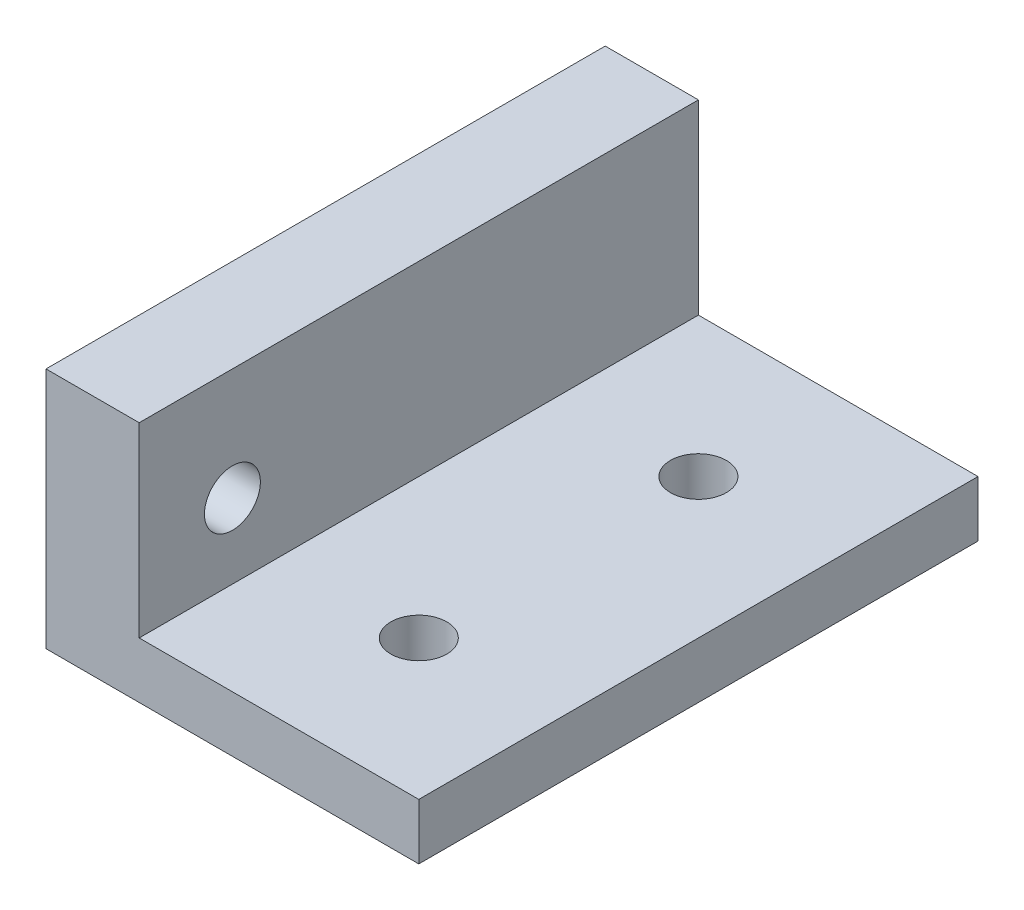
ISO-10303-21;
HEADER;
FILE_DESCRIPTION(('STEP AP214'),'2;1');
FILE_NAME('part.step','',(''),(''),'','','');
FILE_SCHEMA(('AUTOMOTIVE_DESIGN { 1 0 10303 214 1 1 1 1 }'));
ENDSEC;
DATA;
#1=APPLICATION_CONTEXT('core data for automotive mechanical design processes');
#2=APPLICATION_PROTOCOL_DEFINITION('international standard','automotive_design',2000,#1);
#3=PRODUCT_CONTEXT('',#1,'mechanical');
#4=PRODUCT('Part','Part','',(#3));
#5=PRODUCT_RELATED_PRODUCT_CATEGORY('part','',(#4));
#6=PRODUCT_DEFINITION_FORMATION('','',#4);
#7=PRODUCT_DEFINITION_CONTEXT('part definition',#1,'design');
#8=PRODUCT_DEFINITION('design','',#6,#7);
#9=PRODUCT_DEFINITION_SHAPE('','',#8);
#10=(LENGTH_UNIT() NAMED_UNIT(*) SI_UNIT(.MILLI.,.METRE.));
#11=(NAMED_UNIT(*) PLANE_ANGLE_UNIT() SI_UNIT($,.RADIAN.));
#12=(NAMED_UNIT(*) SI_UNIT($,.STERADIAN.) SOLID_ANGLE_UNIT());
#13=UNCERTAINTY_MEASURE_WITH_UNIT(LENGTH_MEASURE(1.E-05),#10,'distance_accuracy_value','');
#14=(GEOMETRIC_REPRESENTATION_CONTEXT(3) GLOBAL_UNCERTAINTY_ASSIGNED_CONTEXT((#13)) GLOBAL_UNIT_ASSIGNED_CONTEXT((#10,
#11,#12)) REPRESENTATION_CONTEXT('',''));
#15=CARTESIAN_POINT('',(0.,0.,0.));
#16=DIRECTION('',(0.,0.,1.));
#17=DIRECTION('',(1.,0.,0.));
#18=AXIS2_PLACEMENT_3D('',#15,#16,#17);
#19=CARTESIAN_POINT('',(10.,3.,-15.));
#20=DIRECTION('',(-1.,0.,0.));
#21=DIRECTION('',(0.,0.,1.));
#22=AXIS2_PLACEMENT_3D('',#19,#20,#21);
#23=PLANE('',#22);
#24=DIRECTION('',(0.,0.,-1.));
#25=VECTOR('',#24,1.);
#26=CARTESIAN_POINT('',(10.,0.,-15.));
#27=LINE('',#26,#25);
#28=CARTESIAN_POINT('',(10.,0.,15.));
#29=VERTEX_POINT('',#28);
#30=CARTESIAN_POINT('',(10.,0.,-15.));
#31=VERTEX_POINT('',#30);
#32=EDGE_CURVE('E98',#29,#31,#27,.T.);
#33=ORIENTED_EDGE('',*,*,#32,.T.);
#34=DIRECTION('',(0.,-1.,0.));
#35=VECTOR('',#34,1.);
#36=CARTESIAN_POINT('',(10.,3.,-15.));
#37=LINE('',#36,#35);
#38=CARTESIAN_POINT('',(10.,3.,-15.));
#39=VERTEX_POINT('',#38);
#40=EDGE_CURVE('E11',#39,#31,#37,.T.);
#41=ORIENTED_EDGE('',*,*,#40,.F.);
#42=DIRECTION('',(0.,0.,-1.));
#43=VECTOR('',#42,1.);
#44=CARTESIAN_POINT('',(10.,3.,-15.));
#45=LINE('',#44,#43);
#46=CARTESIAN_POINT('',(10.,3.,15.));
#47=VERTEX_POINT('',#46);
#48=EDGE_CURVE('E92',#47,#39,#45,.T.);
#49=ORIENTED_EDGE('',*,*,#48,.F.);
#50=DIRECTION('',(0.,-1.,0.));
#51=VECTOR('',#50,1.);
#52=CARTESIAN_POINT('',(10.,3.,15.));
#53=LINE('',#52,#51);
#54=EDGE_CURVE('E83',#47,#29,#53,.T.);
#55=ORIENTED_EDGE('',*,*,#54,.T.);
#56=EDGE_LOOP('',(#33,#41,#49,#55));
#57=FACE_BOUND('',#56,.T.);
#58=ADVANCED_FACE('F39',(#57),#23,.F.);
#59=CARTESIAN_POINT('',(-10.,3.,-15.));
#60=DIRECTION('',(0.,0.,1.));
#61=DIRECTION('',(1.,0.,0.));
#62=AXIS2_PLACEMENT_3D('',#59,#60,#61);
#63=PLANE('',#62);
#64=DIRECTION('',(-1.,0.,0.));
#65=VECTOR('',#64,1.);
#66=CARTESIAN_POINT('',(-10.,0.,-15.));
#67=LINE('',#66,#65);
#68=CARTESIAN_POINT('',(-10.,0.,-15.));
#69=VERTEX_POINT('',#68);
#70=EDGE_CURVE('E102',#31,#69,#67,.T.);
#71=ORIENTED_EDGE('',*,*,#70,.T.);
#72=DIRECTION('',(0.,-1.,0.));
#73=VECTOR('',#72,1.);
#74=CARTESIAN_POINT('',(-10.,3.,-15.));
#75=LINE('',#74,#73);
#76=CARTESIAN_POINT('',(-10.,13.,-15.));
#77=VERTEX_POINT('',#76);
#78=EDGE_CURVE('E48',#77,#69,#75,.T.);
#79=ORIENTED_EDGE('',*,*,#78,.F.);
#80=DIRECTION('',(-1.,0.,0.));
#81=VECTOR('',#80,1.);
#82=CARTESIAN_POINT('',(-10.,13.,-15.));
#83=LINE('',#82,#81);
#84=CARTESIAN_POINT('',(-5.,13.,-15.));
#85=VERTEX_POINT('',#84);
#86=EDGE_CURVE('E133',#85,#77,#83,.T.);
#87=ORIENTED_EDGE('',*,*,#86,.F.);
#88=DIRECTION('',(0.,-1.,0.));
#89=VECTOR('',#88,1.);
#90=CARTESIAN_POINT('',(-5.,13.,-15.));
#91=LINE('',#90,#89);
#92=CARTESIAN_POINT('',(-5.,3.,-15.));
#93=VERTEX_POINT('',#92);
#94=EDGE_CURVE('E110',#85,#93,#91,.T.);
#95=ORIENTED_EDGE('',*,*,#94,.T.);
#96=DIRECTION('',(-1.,0.,0.));
#97=VECTOR('',#96,1.);
#98=CARTESIAN_POINT('',(-10.,3.,-15.));
#99=LINE('',#98,#97);
#100=EDGE_CURVE('E155',#39,#93,#99,.T.);
#101=ORIENTED_EDGE('',*,*,#100,.F.);
#102=ORIENTED_EDGE('',*,*,#40,.T.);
#103=EDGE_LOOP('',(#71,#79,#87,#95,#101,#102));
#104=FACE_BOUND('',#103,.T.);
#105=ADVANCED_FACE('F130',(#104),#63,.F.);
#106=CARTESIAN_POINT('',(-10.,3.,-15.));
#107=DIRECTION('',(1.,0.,0.));
#108=DIRECTION('',(0.,0.,-1.));
#109=AXIS2_PLACEMENT_3D('',#106,#107,#108);
#110=PLANE('',#109);
#111=CARTESIAN_POINT('',(-10.,7.,10.));
#112=DIRECTION('',(-1.,0.,0.));
#113=DIRECTION('',(0.,0.,1.));
#114=AXIS2_PLACEMENT_3D('',#111,#112,#113);
#115=CIRCLE('',#114,1.5);
#116=CARTESIAN_POINT('',(-10.,7.,11.5));
#117=VERTEX_POINT('',#116);
#118=EDGE_CURVE('E171',#117,#117,#115,.T.);
#119=ORIENTED_EDGE('',*,*,#118,.F.);
#120=EDGE_LOOP('',(#119));
#121=FACE_BOUND('',#120,.T.);
#122=DIRECTION('',(0.,0.,1.));
#123=VECTOR('',#122,1.);
#124=CARTESIAN_POINT('',(-10.,0.,-15.));
#125=LINE('',#124,#123);
#126=CARTESIAN_POINT('',(-10.,0.,15.));
#127=VERTEX_POINT('',#126);
#128=EDGE_CURVE('E93',#69,#127,#125,.T.);
#129=ORIENTED_EDGE('',*,*,#128,.T.);
#130=DIRECTION('',(0.,-1.,0.));
#131=VECTOR('',#130,1.);
#132=CARTESIAN_POINT('',(-10.,3.,15.));
#133=LINE('',#132,#131);
#134=CARTESIAN_POINT('',(-10.,13.,15.));
#135=VERTEX_POINT('',#134);
#136=EDGE_CURVE('E87',#135,#127,#133,.T.);
#137=ORIENTED_EDGE('',*,*,#136,.F.);
#138=DIRECTION('',(0.,0.,1.));
#139=VECTOR('',#138,1.);
#140=CARTESIAN_POINT('',(-10.,13.,-15.));
#141=LINE('',#140,#139);
#142=EDGE_CURVE('E126',#77,#135,#141,.T.);
#143=ORIENTED_EDGE('',*,*,#142,.F.);
#144=ORIENTED_EDGE('',*,*,#78,.T.);
#145=EDGE_LOOP('',(#129,#137,#143,#144));
#146=FACE_BOUND('',#145,.T.);
#147=ADVANCED_FACE('F124',(#121,#146),#110,.F.);
#148=CARTESIAN_POINT('',(-10.,3.,15.));
#149=DIRECTION('',(0.,0.,-1.));
#150=DIRECTION('',(-1.,0.,0.));
#151=AXIS2_PLACEMENT_3D('',#148,#149,#150);
#152=PLANE('',#151);
#153=DIRECTION('',(1.,0.,0.));
#154=VECTOR('',#153,1.);
#155=CARTESIAN_POINT('',(-10.,0.,15.));
#156=LINE('',#155,#154);
#157=EDGE_CURVE('E80',#127,#29,#156,.T.);
#158=ORIENTED_EDGE('',*,*,#157,.T.);
#159=ORIENTED_EDGE('',*,*,#54,.F.);
#160=DIRECTION('',(1.,0.,0.));
#161=VECTOR('',#160,1.);
#162=CARTESIAN_POINT('',(-10.,3.,15.));
#163=LINE('',#162,#161);
#164=CARTESIAN_POINT('',(-5.,3.,15.));
#165=VERTEX_POINT('',#164);
#166=EDGE_CURVE('E60',#165,#47,#163,.T.);
#167=ORIENTED_EDGE('',*,*,#166,.F.);
#168=DIRECTION('',(0.,-1.,0.));
#169=VECTOR('',#168,1.);
#170=CARTESIAN_POINT('',(-5.,13.,15.));
#171=LINE('',#170,#169);
#172=CARTESIAN_POINT('',(-5.,13.,15.));
#173=VERTEX_POINT('',#172);
#174=EDGE_CURVE('E104',#173,#165,#171,.T.);
#175=ORIENTED_EDGE('',*,*,#174,.F.);
#176=DIRECTION('',(1.,0.,0.));
#177=VECTOR('',#176,1.);
#178=CARTESIAN_POINT('',(-10.,13.,15.));
#179=LINE('',#178,#177);
#180=EDGE_CURVE('E148',#135,#173,#179,.T.);
#181=ORIENTED_EDGE('',*,*,#180,.F.);
#182=ORIENTED_EDGE('',*,*,#136,.T.);
#183=EDGE_LOOP('',(#158,#159,#167,#175,#181,#182));
#184=FACE_BOUND('',#183,.T.);
#185=ADVANCED_FACE('F82',(#184),#152,.F.);
#186=CARTESIAN_POINT('',(0.,3.,0.));
#187=DIRECTION('',(0.,1.,0.));
#188=DIRECTION('',(0.,0.,1.));
#189=AXIS2_PLACEMENT_3D('',#186,#187,#188);
#190=PLANE('',#189);
#191=CARTESIAN_POINT('',(2.5,3.,7.5));
#192=DIRECTION('',(0.,1.,0.));
#193=DIRECTION('',(0.,0.,1.));
#194=AXIS2_PLACEMENT_3D('',#191,#192,#193);
#195=CIRCLE('',#194,1.5);
#196=CARTESIAN_POINT('',(2.5,3.,9.00000000000001));
#197=VERTEX_POINT('',#196);
#198=EDGE_CURVE('E184',#197,#197,#195,.T.);
#199=ORIENTED_EDGE('',*,*,#198,.F.);
#200=EDGE_LOOP('',(#199));
#201=FACE_BOUND('',#200,.T.);
#202=CARTESIAN_POINT('',(2.5,3.,-7.5));
#203=DIRECTION('',(0.,1.,0.));
#204=DIRECTION('',(0.,0.,1.));
#205=AXIS2_PLACEMENT_3D('',#202,#203,#204);
#206=CIRCLE('',#205,1.5);
#207=CARTESIAN_POINT('',(2.5,3.,-6.));
#208=VERTEX_POINT('',#207);
#209=EDGE_CURVE('E176',#208,#208,#206,.T.);
#210=ORIENTED_EDGE('',*,*,#209,.F.);
#211=EDGE_LOOP('',(#210));
#212=FACE_BOUND('',#211,.T.);
#213=DIRECTION('',(0.,0.,-1.));
#214=VECTOR('',#213,1.);
#215=CARTESIAN_POINT('',(-5.,3.,-15.));
#216=LINE('',#215,#214);
#217=EDGE_CURVE('E55',#165,#93,#216,.T.);
#218=ORIENTED_EDGE('',*,*,#217,.F.);
#219=ORIENTED_EDGE('',*,*,#166,.T.);
#220=ORIENTED_EDGE('',*,*,#48,.T.);
#221=ORIENTED_EDGE('',*,*,#100,.T.);
#222=EDGE_LOOP('',(#218,#219,#220,#221));
#223=FACE_BOUND('',#222,.T.);
#224=ADVANCED_FACE('F159',(#201,#212,#223),#190,.T.);
#225=CARTESIAN_POINT('',(0.,0.,0.));
#226=DIRECTION('',(0.,1.,0.));
#227=DIRECTION('',(0.,0.,1.));
#228=AXIS2_PLACEMENT_3D('',#225,#226,#227);
#229=PLANE('',#228);
#230=CARTESIAN_POINT('',(2.5,0.,7.5));
#231=DIRECTION('',(0.,1.,0.));
#232=DIRECTION('',(0.,0.,1.));
#233=AXIS2_PLACEMENT_3D('',#230,#231,#232);
#234=CIRCLE('',#233,1.5);
#235=CARTESIAN_POINT('',(2.5,0.,9.00000000000001));
#236=VERTEX_POINT('',#235);
#237=EDGE_CURVE('E175',#236,#236,#234,.T.);
#238=ORIENTED_EDGE('',*,*,#237,.T.);
#239=EDGE_LOOP('',(#238));
#240=FACE_BOUND('',#239,.T.);
#241=CARTESIAN_POINT('',(2.5,0.,-7.5));
#242=DIRECTION('',(0.,1.,0.));
#243=DIRECTION('',(0.,0.,1.));
#244=AXIS2_PLACEMENT_3D('',#241,#242,#243);
#245=CIRCLE('',#244,1.5);
#246=CARTESIAN_POINT('',(2.5,0.,-6.));
#247=VERTEX_POINT('',#246);
#248=EDGE_CURVE('E180',#247,#247,#245,.T.);
#249=ORIENTED_EDGE('',*,*,#248,.T.);
#250=EDGE_LOOP('',(#249));
#251=FACE_BOUND('',#250,.T.);
#252=ORIENTED_EDGE('',*,*,#32,.F.);
#253=ORIENTED_EDGE('',*,*,#157,.F.);
#254=ORIENTED_EDGE('',*,*,#128,.F.);
#255=ORIENTED_EDGE('',*,*,#70,.F.);
#256=EDGE_LOOP('',(#252,#253,#254,#255));
#257=FACE_BOUND('',#256,.T.);
#258=ADVANCED_FACE('F101',(#240,#251,#257),#229,.F.);
#259=CARTESIAN_POINT('',(-5.,13.,-15.));
#260=DIRECTION('',(-1.,0.,0.));
#261=DIRECTION('',(0.,0.,1.));
#262=AXIS2_PLACEMENT_3D('',#259,#260,#261);
#263=PLANE('',#262);
#264=CARTESIAN_POINT('',(-5.,7.,10.));
#265=DIRECTION('',(-1.,0.,0.));
#266=DIRECTION('',(0.,0.,1.));
#267=AXIS2_PLACEMENT_3D('',#264,#265,#266);
#268=CIRCLE('',#267,1.5);
#269=CARTESIAN_POINT('',(-5.,7.,11.5));
#270=VERTEX_POINT('',#269);
#271=EDGE_CURVE('E42',#270,#270,#268,.T.);
#272=ORIENTED_EDGE('',*,*,#271,.T.);
#273=EDGE_LOOP('',(#272));
#274=FACE_BOUND('',#273,.T.);
#275=ORIENTED_EDGE('',*,*,#217,.T.);
#276=ORIENTED_EDGE('',*,*,#94,.F.);
#277=DIRECTION('',(0.,0.,-1.));
#278=VECTOR('',#277,1.);
#279=CARTESIAN_POINT('',(-5.,13.,-15.));
#280=LINE('',#279,#278);
#281=EDGE_CURVE('E141',#173,#85,#280,.T.);
#282=ORIENTED_EDGE('',*,*,#281,.F.);
#283=ORIENTED_EDGE('',*,*,#174,.T.);
#284=EDGE_LOOP('',(#275,#276,#282,#283));
#285=FACE_BOUND('',#284,.T.);
#286=ADVANCED_FACE('F161',(#274,#285),#263,.F.);
#287=CARTESIAN_POINT('',(0.,13.,0.));
#288=DIRECTION('',(0.,1.,0.));
#289=DIRECTION('',(0.,0.,1.));
#290=AXIS2_PLACEMENT_3D('',#287,#288,#289);
#291=PLANE('',#290);
#292=ORIENTED_EDGE('',*,*,#142,.T.);
#293=ORIENTED_EDGE('',*,*,#180,.T.);
#294=ORIENTED_EDGE('',*,*,#281,.T.);
#295=ORIENTED_EDGE('',*,*,#86,.T.);
#296=EDGE_LOOP('',(#292,#293,#294,#295));
#297=FACE_BOUND('',#296,.T.);
#298=ADVANCED_FACE('F137',(#297),#291,.T.);
#299=CARTESIAN_POINT('',(0.,7.,10.));
#300=DIRECTION('',(-1.,0.,0.));
#301=DIRECTION('',(0.,0.,1.));
#302=AXIS2_PLACEMENT_3D('',#299,#300,#301);
#303=CYLINDRICAL_SURFACE('',#302,1.5);
#304=ORIENTED_EDGE('',*,*,#118,.T.);
#305=EDGE_LOOP('',(#304));
#306=FACE_BOUND('',#305,.T.);
#307=ORIENTED_EDGE('',*,*,#271,.F.);
#308=EDGE_LOOP('',(#307));
#309=FACE_BOUND('',#308,.T.);
#310=ADVANCED_FACE('F207',(#306,#309),#303,.F.);
#311=CARTESIAN_POINT('',(2.5,0.,-7.5));
#312=DIRECTION('',(0.,1.,0.));
#313=DIRECTION('',(0.,0.,1.));
#314=AXIS2_PLACEMENT_3D('',#311,#312,#313);
#315=CYLINDRICAL_SURFACE('',#314,1.5);
#316=ORIENTED_EDGE('',*,*,#248,.F.);
#317=EDGE_LOOP('',(#316));
#318=FACE_BOUND('',#317,.T.);
#319=ORIENTED_EDGE('',*,*,#209,.T.);
#320=EDGE_LOOP('',(#319));
#321=FACE_BOUND('',#320,.T.);
#322=ADVANCED_FACE('F197',(#318,#321),#315,.F.);
#323=CARTESIAN_POINT('',(2.5,0.,7.5));
#324=DIRECTION('',(0.,1.,0.));
#325=DIRECTION('',(0.,0.,1.));
#326=AXIS2_PLACEMENT_3D('',#323,#324,#325);
#327=CYLINDRICAL_SURFACE('',#326,1.5);
#328=ORIENTED_EDGE('',*,*,#237,.F.);
#329=EDGE_LOOP('',(#328));
#330=FACE_BOUND('',#329,.T.);
#331=ORIENTED_EDGE('',*,*,#198,.T.);
#332=EDGE_LOOP('',(#331));
#333=FACE_BOUND('',#332,.T.);
#334=ADVANCED_FACE('F194',(#330,#333),#327,.F.);
#335=CLOSED_SHELL('',(#58,#105,#147,#185,#224,#258,#286,#298,#310,#322,#334));
#336=MANIFOLD_SOLID_BREP('B2',#335);
#337=ADVANCED_BREP_SHAPE_REPRESENTATION('',(#18,#336),#14);
#338=SHAPE_DEFINITION_REPRESENTATION(#9,#337);
ENDSEC;
END-ISO-10303-21;
